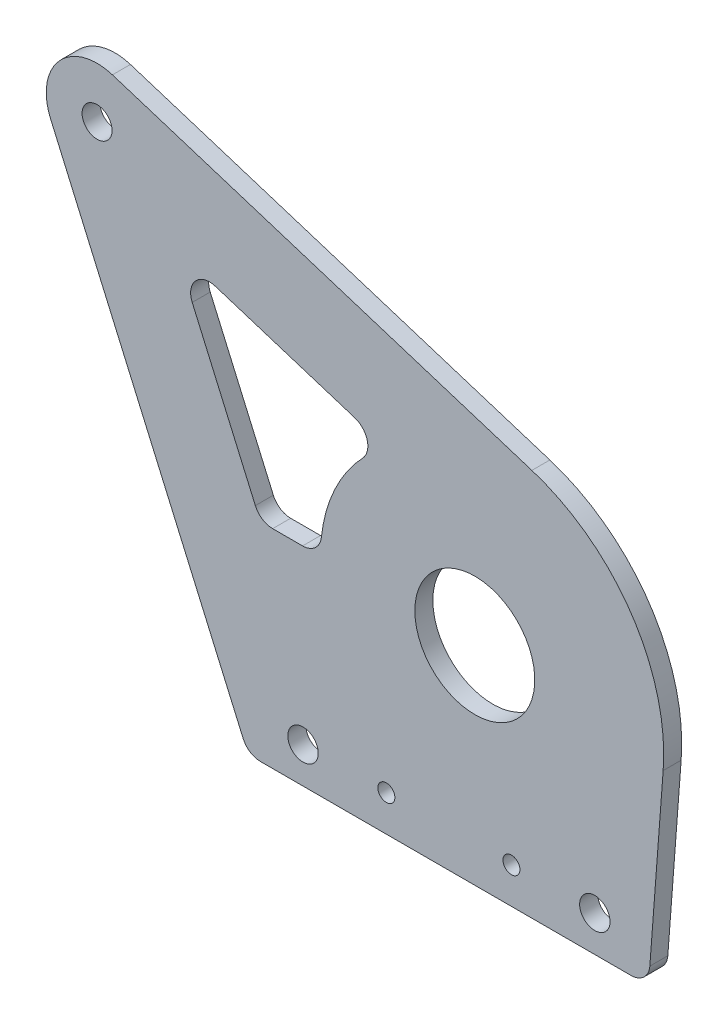
ISO-10303-21;
HEADER;
FILE_DESCRIPTION(('STEP AP214'),'2;1');
FILE_NAME('part.step','',(''),(''),'','','');
FILE_SCHEMA(('AUTOMOTIVE_DESIGN { 1 0 10303 214 1 1 1 1 }'));
ENDSEC;
DATA;
#1=APPLICATION_CONTEXT('core data for automotive mechanical design processes');
#2=APPLICATION_PROTOCOL_DEFINITION('international standard','automotive_design',2000,#1);
#3=PRODUCT_CONTEXT('',#1,'mechanical');
#4=PRODUCT('Part','Part','',(#3));
#5=PRODUCT_RELATED_PRODUCT_CATEGORY('part','',(#4));
#6=PRODUCT_DEFINITION_FORMATION('','',#4);
#7=PRODUCT_DEFINITION_CONTEXT('part definition',#1,'design');
#8=PRODUCT_DEFINITION('design','',#6,#7);
#9=PRODUCT_DEFINITION_SHAPE('','',#8);
#10=(LENGTH_UNIT() NAMED_UNIT(*) SI_UNIT(.MILLI.,.METRE.));
#11=(NAMED_UNIT(*) PLANE_ANGLE_UNIT() SI_UNIT($,.RADIAN.));
#12=(NAMED_UNIT(*) SI_UNIT($,.STERADIAN.) SOLID_ANGLE_UNIT());
#13=UNCERTAINTY_MEASURE_WITH_UNIT(LENGTH_MEASURE(1.E-05),#10,'distance_accuracy_value','');
#14=(GEOMETRIC_REPRESENTATION_CONTEXT(3) GLOBAL_UNCERTAINTY_ASSIGNED_CONTEXT((#13)) GLOBAL_UNIT_ASSIGNED_CONTEXT((#10,
#11,#12)) REPRESENTATION_CONTEXT('',''));
#15=CARTESIAN_POINT('',(0.,0.,0.));
#16=DIRECTION('',(0.,0.,1.));
#17=DIRECTION('',(1.,0.,0.));
#18=AXIS2_PLACEMENT_3D('',#15,#16,#17);
#19=CARTESIAN_POINT('',(-45.9765237436757,55.,34.7625));
#20=DIRECTION('',(0.,0.,-1.));
#21=DIRECTION('',(-1.,0.,0.));
#22=AXIS2_PLACEMENT_3D('',#19,#20,#21);
#23=PLANE('',#22);
#24=DIRECTION('',(1.,0.,0.));
#25=VECTOR('',#24,1.);
#26=CARTESIAN_POINT('',(-102.765720109967,55.,34.7625));
#27=LINE('',#26,#25);
#28=CARTESIAN_POINT('',(-99.4950500240803,55.,34.7625));
#29=VERTEX_POINT('',#28);
#30=CARTESIAN_POINT('',(-91.5782301262224,55.,34.7625));
#31=VERTEX_POINT('',#30);
#32=EDGE_CURVE('E273',#29,#31,#27,.T.);
#33=ORIENTED_EDGE('',*,*,#32,.F.);
#34=CARTESIAN_POINT('',(-99.4950500240803,60.,34.7625));
#35=DIRECTION('',(0.,0.,-1.));
#36=DIRECTION('',(-1.,0.,0.));
#37=AXIS2_PLACEMENT_3D('',#34,#35,#36);
#38=CIRCLE('',#37,5.);
#39=CARTESIAN_POINT('',(-104.076169129461,57.9966658435705,34.7625));
#40=VERTEX_POINT('',#39);
#41=EDGE_CURVE('E238',#29,#40,#38,.T.);
#42=ORIENTED_EDGE('',*,*,#41,.T.);
#43=DIRECTION('',(0.400666831285897,-0.916223821076116,0.));
#44=VECTOR('',#43,1.);
#45=CARTESIAN_POINT('',(-125.205078879288,106.313144559887,34.7625));
#46=LINE('',#45,#44);
#47=CARTESIAN_POINT('',(-120.7896266242,96.2161207459809,34.7625));
#48=VERTEX_POINT('',#47);
#49=EDGE_CURVE('E248',#48,#40,#46,.T.);
#50=ORIENTED_EDGE('',*,*,#49,.F.);
#51=CARTESIAN_POINT('',(-116.208507518819,98.2194549024104,34.7625));
#52=DIRECTION('',(0.,0.,-1.));
#53=DIRECTION('',(-1.,0.,0.));
#54=AXIS2_PLACEMENT_3D('',#51,#52,#53);
#55=CIRCLE('',#54,5.);
#56=CARTESIAN_POINT('',(-114.699020514716,102.986157010204,34.7625));
#57=VERTEX_POINT('',#56);
#58=EDGE_CURVE('E48',#48,#57,#55,.T.);
#59=ORIENTED_EDGE('',*,*,#58,.T.);
#60=DIRECTION('',(-0.95334042155868,0.30189740082074,0.));
#61=VECTOR('',#60,1.);
#62=CARTESIAN_POINT('',(-125.205078879288,106.313144559887,34.7625));
#63=LINE('',#62,#61);
#64=CARTESIAN_POINT('',(-77.7884915726018,91.297580192781,34.7625));
#65=VERTEX_POINT('',#64);
#66=EDGE_CURVE('E247',#65,#57,#63,.T.);
#67=ORIENTED_EDGE('',*,*,#66,.F.);
#68=CARTESIAN_POINT('',(-79.2979785767055,86.5308780849876,34.7625));
#69=DIRECTION('',(0.,0.,-1.));
#70=DIRECTION('',(-1.,0.,0.));
#71=AXIS2_PLACEMENT_3D('',#68,#69,#70);
#72=CIRCLE('',#71,5.);
#73=CARTESIAN_POINT('',(-75.6662123823698,83.0942701193214,34.7625));
#74=VERTEX_POINT('',#73);
#75=EDGE_CURVE('E230',#65,#74,#72,.T.);
#76=ORIENTED_EDGE('',*,*,#75,.T.);
#77=CARTESIAN_POINT('',(-45.9765237436757,55.,34.7625));
#78=DIRECTION('',(0.,0.,-1.));
#79=DIRECTION('',(1.,0.,0.));
#80=AXIS2_PLACEMENT_3D('',#77,#78,#79);
#81=CIRCLE('',#80,40.875);
#82=CARTESIAN_POINT('',(-86.608016896517,59.4550408719346,34.7625));
#83=VERTEX_POINT('',#82);
#84=EDGE_CURVE('E257',#83,#74,#81,.T.);
#85=ORIENTED_EDGE('',*,*,#84,.F.);
#86=CARTESIAN_POINT('',(-91.5782301262224,60.,34.7625));
#87=DIRECTION('',(0.,0.,-1.));
#88=DIRECTION('',(-1.,0.,0.));
#89=AXIS2_PLACEMENT_3D('',#86,#87,#88);
#90=CIRCLE('',#89,5.);
#91=EDGE_CURVE('E234',#83,#31,#90,.T.);
#92=ORIENTED_EDGE('',*,*,#91,.T.);
#93=EDGE_LOOP('',(#33,#42,#50,#59,#67,#76,#85,#92));
#94=FACE_BOUND('',#93,.T.);
#95=CARTESIAN_POINT('',(-69.3886421718834,9.525,34.7625));
#96=DIRECTION('',(0.,0.,1.));
#97=DIRECTION('',(1.,0.,0.));
#98=AXIS2_PLACEMENT_3D('',#95,#96,#97);
#99=CIRCLE('',#98,2.24999999999999);
#100=CARTESIAN_POINT('',(-67.1386421718834,9.525,34.7625));
#101=VERTEX_POINT('',#100);
#102=EDGE_CURVE('E271',#101,#101,#99,.T.);
#103=ORIENTED_EDGE('',*,*,#102,.F.);
#104=EDGE_LOOP('',(#103));
#105=FACE_BOUND('',#104,.T.);
#106=CARTESIAN_POINT('',(-91.4598564098834,9.52499999999999,34.7625));
#107=DIRECTION('',(0.,0.,1.));
#108=DIRECTION('',(1.,0.,0.));
#109=AXIS2_PLACEMENT_3D('',#106,#107,#108);
#110=CIRCLE('',#109,4.025);
#111=CARTESIAN_POINT('',(-87.4348564098834,9.52499999999999,34.7625));
#112=VERTEX_POINT('',#111);
#113=EDGE_CURVE('E192',#112,#112,#110,.T.);
#114=ORIENTED_EDGE('',*,*,#113,.F.);
#115=EDGE_LOOP('',(#114));
#116=FACE_BOUND('',#115,.T.);
#117=CARTESIAN_POINT('',(-14.2106070377648,9.52500000000001,34.7625));
#118=DIRECTION('',(0.,0.,1.));
#119=DIRECTION('',(1.,0.,0.));
#120=AXIS2_PLACEMENT_3D('',#117,#118,#119);
#121=CIRCLE('',#120,4.025);
#122=CARTESIAN_POINT('',(-10.1856070377648,9.52500000000001,34.7625));
#123=VERTEX_POINT('',#122);
#124=EDGE_CURVE('E295',#123,#123,#121,.T.);
#125=ORIENTED_EDGE('',*,*,#124,.F.);
#126=EDGE_LOOP('',(#125));
#127=FACE_BOUND('',#126,.T.);
#128=CARTESIAN_POINT('',(-45.9765237436757,55.,34.7625));
#129=DIRECTION('',(0.,0.,-1.));
#130=DIRECTION('',(-1.,0.,0.));
#131=AXIS2_PLACEMENT_3D('',#128,#129,#130);
#132=CIRCLE('',#131,15.875);
#133=CARTESIAN_POINT('',(-61.8515237436757,55.,34.7625));
#134=VERTEX_POINT('',#133);
#135=EDGE_CURVE('E195',#134,#134,#132,.T.);
#136=ORIENTED_EDGE('',*,*,#135,.T.);
#137=EDGE_LOOP('',(#136));
#138=FACE_BOUND('',#137,.T.);
#139=CARTESIAN_POINT('',(-145.976523743676,125.,34.7625));
#140=DIRECTION('',(0.,0.,-1.));
#141=DIRECTION('',(-1.,0.,0.));
#142=AXIS2_PLACEMENT_3D('',#139,#140,#141);
#143=CIRCLE('',#142,3.96874999999999);
#144=CARTESIAN_POINT('',(-149.945273743676,125.,34.7625));
#145=VERTEX_POINT('',#144);
#146=EDGE_CURVE('E191',#145,#145,#143,.T.);
#147=ORIENTED_EDGE('',*,*,#146,.T.);
#148=EDGE_LOOP('',(#147));
#149=FACE_BOUND('',#148,.T.);
#150=DIRECTION('',(1.,0.,0.));
#151=VECTOR('',#150,1.);
#152=CARTESIAN_POINT('',(0.,0.,34.7625));
#153=LINE('',#152,#151);
#154=CARTESIAN_POINT('',(-102.729329914113,0.,34.7625));
#155=VERTEX_POINT('',#154);
#156=CARTESIAN_POINT('',(-4.63553198775184,0.,34.7625));
#157=VERTEX_POINT('',#156);
#158=EDGE_CURVE('E308',#155,#157,#153,.T.);
#159=ORIENTED_EDGE('',*,*,#158,.T.);
#160=CARTESIAN_POINT('',(-4.63553198775184,5.,34.7625));
#161=DIRECTION('',(0.,0.,-1.));
#162=DIRECTION('',(-1.,0.,0.));
#163=AXIS2_PLACEMENT_3D('',#160,#161,#162);
#164=CIRCLE('',#163,5.);
#165=CARTESIAN_POINT('',(0.350180832343764,4.62228625185952,34.7625));
#166=VERTEX_POINT('',#165);
#167=EDGE_CURVE('E207',#157,#166,#164,.F.);
#168=ORIENTED_EDGE('',*,*,#167,.T.);
#169=DIRECTION('',(0.0755427496280952,0.997142564019121,0.));
#170=VECTOR('',#169,1.);
#171=CARTESIAN_POINT('',(0.,0.,34.7625));
#172=LINE('',#171,#170);
#173=CARTESIAN_POINT('',(3.88060445728038,51.2228625185952,34.7625));
#174=VERTEX_POINT('',#173);
#175=EDGE_CURVE('E170',#166,#174,#172,.T.);
#176=ORIENTED_EDGE('',*,*,#175,.T.);
#177=CARTESIAN_POINT('',(-45.9765237436757,55.,34.7625));
#178=DIRECTION('',(0.,0.,1.));
#179=DIRECTION('',(-1.,0.,0.));
#180=AXIS2_PLACEMENT_3D('',#177,#178,#179);
#181=CIRCLE('',#180,50.);
#182=CARTESIAN_POINT('',(-30.8816537026386,102.667021077934,34.7625));
#183=VERTEX_POINT('',#182);
#184=EDGE_CURVE('E164',#174,#183,#181,.T.);
#185=ORIENTED_EDGE('',*,*,#184,.T.);
#186=DIRECTION('',(-0.95334042155868,0.301897400820741,0.));
#187=VECTOR('',#186,1.);
#188=CARTESIAN_POINT('',(-141.914219316021,137.828063458088,34.7625));
#189=LINE('',#188,#187);
#190=CARTESIAN_POINT('',(-141.914219316021,137.828063458088,34.7625));
#191=VERTEX_POINT('',#190);
#192=EDGE_CURVE('E153',#183,#191,#189,.T.);
#193=ORIENTED_EDGE('',*,*,#192,.T.);
#194=CARTESIAN_POINT('',(-145.976523743676,125.,34.7625));
#195=DIRECTION('',(0.,0.,1.));
#196=DIRECTION('',(1.,0.,0.));
#197=AXIS2_PLACEMENT_3D('',#194,#195,#196);
#198=CIRCLE('',#197,13.4559105729665);
#199=CARTESIAN_POINT('',(-158.305149544898,119.608662948663,34.7625));
#200=VERTEX_POINT('',#199);
#201=EDGE_CURVE('E163',#191,#200,#198,.T.);
#202=ORIENTED_EDGE('',*,*,#201,.T.);
#203=DIRECTION('',(0.400666831285897,-0.916223821076116,0.));
#204=VECTOR('',#203,1.);
#205=CARTESIAN_POINT('',(-106.,0.,34.7625));
#206=LINE('',#205,#204);
#207=CARTESIAN_POINT('',(-107.310449019494,2.9966658435705,34.7625));
#208=VERTEX_POINT('',#207);
#209=EDGE_CURVE('E305',#200,#208,#206,.T.);
#210=ORIENTED_EDGE('',*,*,#209,.T.);
#211=CARTESIAN_POINT('',(-102.729329914113,4.99999999999998,34.7625));
#212=DIRECTION('',(0.,0.,-1.));
#213=DIRECTION('',(-1.,0.,0.));
#214=AXIS2_PLACEMENT_3D('',#211,#212,#213);
#215=CIRCLE('',#214,5.);
#216=EDGE_CURVE('E205',#208,#155,#215,.F.);
#217=ORIENTED_EDGE('',*,*,#216,.T.);
#218=EDGE_LOOP('',(#159,#168,#176,#185,#193,#202,#210,#217));
#219=FACE_BOUND('',#218,.T.);
#220=CARTESIAN_POINT('',(-36.2818211132944,9.525,34.7625));
#221=DIRECTION('',(0.,0.,1.));
#222=DIRECTION('',(1.,0.,0.));
#223=AXIS2_PLACEMENT_3D('',#220,#221,#222);
#224=CIRCLE('',#223,2.25);
#225=CARTESIAN_POINT('',(-34.0318211132945,9.525,34.7625));
#226=VERTEX_POINT('',#225);
#227=EDGE_CURVE('E283',#226,#226,#224,.T.);
#228=ORIENTED_EDGE('',*,*,#227,.F.);
#229=EDGE_LOOP('',(#228));
#230=FACE_BOUND('',#229,.T.);
#231=ADVANCED_FACE('F40',(#94,#105,#116,#127,#138,#149,#219,#230),#23,.F.);
#232=CARTESIAN_POINT('',(-45.9765237436757,55.,34.7625));
#233=DIRECTION('',(0.,0.,-1.));
#234=DIRECTION('',(-1.,0.,0.));
#235=AXIS2_PLACEMENT_3D('',#232,#233,#234);
#236=CYLINDRICAL_SURFACE('',#235,50.);
#237=CARTESIAN_POINT('',(-45.9765237436757,55.,30.));
#238=DIRECTION('',(0.,0.,1.));
#239=DIRECTION('',(-1.,0.,0.));
#240=AXIS2_PLACEMENT_3D('',#237,#238,#239);
#241=CIRCLE('',#240,50.);
#242=CARTESIAN_POINT('',(3.88060445728038,51.2228625185952,30.));
#243=VERTEX_POINT('',#242);
#244=CARTESIAN_POINT('',(-30.8816537026386,102.667021077934,30.));
#245=VERTEX_POINT('',#244);
#246=EDGE_CURVE('E178',#243,#245,#241,.T.);
#247=ORIENTED_EDGE('',*,*,#246,.T.);
#248=DIRECTION('',(0.,0.,-1.));
#249=VECTOR('',#248,1.);
#250=CARTESIAN_POINT('',(-30.8816537026386,102.667021077934,34.7625));
#251=LINE('',#250,#249);
#252=EDGE_CURVE('E157',#183,#245,#251,.T.);
#253=ORIENTED_EDGE('',*,*,#252,.F.);
#254=ORIENTED_EDGE('',*,*,#184,.F.);
#255=DIRECTION('',(0.,0.,-1.));
#256=VECTOR('',#255,1.);
#257=CARTESIAN_POINT('',(3.88060445728038,51.2228625185952,34.7625));
#258=LINE('',#257,#256);
#259=EDGE_CURVE('E311',#174,#243,#258,.T.);
#260=ORIENTED_EDGE('',*,*,#259,.T.);
#261=EDGE_LOOP('',(#247,#253,#254,#260));
#262=FACE_BOUND('',#261,.T.);
#263=ADVANCED_FACE('F176',(#262),#236,.T.);
#264=CARTESIAN_POINT('',(-141.914219316021,137.828063458088,34.7625));
#265=DIRECTION('',(-0.301897400820741,-0.95334042155868,0.));
#266=DIRECTION('',(0.95334042155868,-0.301897400820741,0.));
#267=AXIS2_PLACEMENT_3D('',#264,#265,#266);
#268=PLANE('',#267);
#269=DIRECTION('',(-0.95334042155868,0.301897400820741,0.));
#270=VECTOR('',#269,1.);
#271=CARTESIAN_POINT('',(-141.914219316021,137.828063458088,30.));
#272=LINE('',#271,#270);
#273=CARTESIAN_POINT('',(-141.914219316021,137.828063458088,30.));
#274=VERTEX_POINT('',#273);
#275=EDGE_CURVE('E313',#245,#274,#272,.T.);
#276=ORIENTED_EDGE('',*,*,#275,.T.);
#277=DIRECTION('',(0.,0.,-1.));
#278=VECTOR('',#277,1.);
#279=CARTESIAN_POINT('',(-141.914219316021,137.828063458088,34.7625));
#280=LINE('',#279,#278);
#281=EDGE_CURVE('E160',#191,#274,#280,.T.);
#282=ORIENTED_EDGE('',*,*,#281,.F.);
#283=ORIENTED_EDGE('',*,*,#192,.F.);
#284=ORIENTED_EDGE('',*,*,#252,.T.);
#285=EDGE_LOOP('',(#276,#282,#283,#284));
#286=FACE_BOUND('',#285,.T.);
#287=ADVANCED_FACE('F155',(#286),#268,.F.);
#288=CARTESIAN_POINT('',(-145.976523743676,125.,34.7625));
#289=DIRECTION('',(0.,0.,-1.));
#290=DIRECTION('',(-1.,0.,0.));
#291=AXIS2_PLACEMENT_3D('',#288,#289,#290);
#292=CYLINDRICAL_SURFACE('',#291,13.4559105729665);
#293=CARTESIAN_POINT('',(-145.976523743676,125.,30.));
#294=DIRECTION('',(0.,0.,1.));
#295=DIRECTION('',(1.,0.,0.));
#296=AXIS2_PLACEMENT_3D('',#293,#294,#295);
#297=CIRCLE('',#296,13.4559105729665);
#298=CARTESIAN_POINT('',(-158.305149544898,119.608662948663,30.));
#299=VERTEX_POINT('',#298);
#300=EDGE_CURVE('E315',#274,#299,#297,.T.);
#301=ORIENTED_EDGE('',*,*,#300,.T.);
#302=DIRECTION('',(0.,0.,-1.));
#303=VECTOR('',#302,1.);
#304=CARTESIAN_POINT('',(-158.305149544898,119.608662948663,34.7625));
#305=LINE('',#304,#303);
#306=EDGE_CURVE('E184',#200,#299,#305,.T.);
#307=ORIENTED_EDGE('',*,*,#306,.F.);
#308=ORIENTED_EDGE('',*,*,#201,.F.);
#309=ORIENTED_EDGE('',*,*,#281,.T.);
#310=EDGE_LOOP('',(#301,#307,#308,#309));
#311=FACE_BOUND('',#310,.T.);
#312=ADVANCED_FACE('F351',(#311),#292,.T.);
#313=CARTESIAN_POINT('',(-106.,0.,34.7625));
#314=DIRECTION('',(0.916223821076116,0.400666831285897,0.));
#315=DIRECTION('',(-0.400666831285897,0.916223821076116,0.));
#316=AXIS2_PLACEMENT_3D('',#313,#314,#315);
#317=PLANE('',#316);
#318=DIRECTION('',(0.400666831285897,-0.916223821076116,0.));
#319=VECTOR('',#318,1.);
#320=CARTESIAN_POINT('',(-106.,0.,30.));
#321=LINE('',#320,#319);
#322=CARTESIAN_POINT('',(-107.310449019494,2.9966658435705,30.));
#323=VERTEX_POINT('',#322);
#324=EDGE_CURVE('E317',#299,#323,#321,.T.);
#325=ORIENTED_EDGE('',*,*,#324,.T.);
#326=DIRECTION('',(0.,0.,-1.));
#327=VECTOR('',#326,1.);
#328=CARTESIAN_POINT('',(-107.310449019494,2.9966658435705,34.7625));
#329=LINE('',#328,#327);
#330=EDGE_CURVE('E209',#323,#208,#329,.F.);
#331=ORIENTED_EDGE('',*,*,#330,.T.);
#332=ORIENTED_EDGE('',*,*,#209,.F.);
#333=ORIENTED_EDGE('',*,*,#306,.T.);
#334=EDGE_LOOP('',(#325,#331,#332,#333));
#335=FACE_BOUND('',#334,.T.);
#336=ADVANCED_FACE('F329',(#335),#317,.F.);
#337=CARTESIAN_POINT('',(0.,0.,34.7625));
#338=DIRECTION('',(0.,1.,0.));
#339=DIRECTION('',(-1.,0.,0.));
#340=AXIS2_PLACEMENT_3D('',#337,#338,#339);
#341=PLANE('',#340);
#342=DIRECTION('',(1.,0.,0.));
#343=VECTOR('',#342,1.);
#344=CARTESIAN_POINT('',(0.,0.,30.));
#345=LINE('',#344,#343);
#346=CARTESIAN_POINT('',(-102.729329914113,0.,30.));
#347=VERTEX_POINT('',#346);
#348=CARTESIAN_POINT('',(-4.63553198775184,0.,30.));
#349=VERTEX_POINT('',#348);
#350=EDGE_CURVE('E320',#347,#349,#345,.T.);
#351=ORIENTED_EDGE('',*,*,#350,.T.);
#352=DIRECTION('',(0.,0.,-1.));
#353=VECTOR('',#352,1.);
#354=CARTESIAN_POINT('',(-4.63553198775184,0.,34.7625));
#355=LINE('',#354,#353);
#356=EDGE_CURVE('E203',#349,#157,#355,.F.);
#357=ORIENTED_EDGE('',*,*,#356,.T.);
#358=ORIENTED_EDGE('',*,*,#158,.F.);
#359=DIRECTION('',(0.,0.,-1.));
#360=VECTOR('',#359,1.);
#361=CARTESIAN_POINT('',(-102.729329914113,0.,34.7625));
#362=LINE('',#361,#360);
#363=EDGE_CURVE('E200',#155,#347,#362,.T.);
#364=ORIENTED_EDGE('',*,*,#363,.T.);
#365=EDGE_LOOP('',(#351,#357,#358,#364));
#366=FACE_BOUND('',#365,.T.);
#367=ADVANCED_FACE('F343',(#366),#341,.F.);
#368=CARTESIAN_POINT('',(0.,0.,34.7625));
#369=DIRECTION('',(-0.997142564019121,0.0755427496280952,0.));
#370=DIRECTION('',(-0.0755427496280952,-0.997142564019121,0.));
#371=AXIS2_PLACEMENT_3D('',#368,#369,#370);
#372=PLANE('',#371);
#373=ORIENTED_EDGE('',*,*,#175,.F.);
#374=DIRECTION('',(0.,0.,-1.));
#375=VECTOR('',#374,1.);
#376=CARTESIAN_POINT('',(0.350180832343764,4.62228625185952,34.7625));
#377=LINE('',#376,#375);
#378=CARTESIAN_POINT('',(0.350180832343764,4.62228625185952,30.));
#379=VERTEX_POINT('',#378);
#380=EDGE_CURVE('E179',#166,#379,#377,.T.);
#381=ORIENTED_EDGE('',*,*,#380,.T.);
#382=DIRECTION('',(0.0755427496280952,0.997142564019121,0.));
#383=VECTOR('',#382,1.);
#384=CARTESIAN_POINT('',(0.,0.,30.));
#385=LINE('',#384,#383);
#386=EDGE_CURVE('E174',#379,#243,#385,.T.);
#387=ORIENTED_EDGE('',*,*,#386,.T.);
#388=ORIENTED_EDGE('',*,*,#259,.F.);
#389=EDGE_LOOP('',(#373,#381,#387,#388));
#390=FACE_BOUND('',#389,.T.);
#391=ADVANCED_FACE('F350',(#390),#372,.F.);
#392=CARTESIAN_POINT('',(-45.9765237436757,55.,30.));
#393=DIRECTION('',(0.,0.,-1.));
#394=DIRECTION('',(-1.,0.,0.));
#395=AXIS2_PLACEMENT_3D('',#392,#393,#394);
#396=PLANE('',#395);
#397=DIRECTION('',(-0.95334042155868,0.30189740082074,0.));
#398=VECTOR('',#397,1.);
#399=CARTESIAN_POINT('',(-125.205078879288,106.313144559887,30.));
#400=LINE('',#399,#398);
#401=CARTESIAN_POINT('',(-77.7884915726018,91.297580192781,30.));
#402=VERTEX_POINT('',#401);
#403=CARTESIAN_POINT('',(-114.699020514716,102.986157010204,30.));
#404=VERTEX_POINT('',#403);
#405=EDGE_CURVE('E269',#402,#404,#400,.T.);
#406=ORIENTED_EDGE('',*,*,#405,.T.);
#407=CARTESIAN_POINT('',(-116.208507518819,98.2194549024104,30.));
#408=DIRECTION('',(0.,0.,-1.));
#409=DIRECTION('',(-1.,0.,0.));
#410=AXIS2_PLACEMENT_3D('',#407,#408,#409);
#411=CIRCLE('',#410,5.);
#412=CARTESIAN_POINT('',(-120.7896266242,96.2161207459809,30.));
#413=VERTEX_POINT('',#412);
#414=EDGE_CURVE('E11',#404,#413,#411,.F.);
#415=ORIENTED_EDGE('',*,*,#414,.T.);
#416=DIRECTION('',(0.400666831285897,-0.916223821076116,0.));
#417=VECTOR('',#416,1.);
#418=CARTESIAN_POINT('',(-125.205078879288,106.313144559887,30.));
#419=LINE('',#418,#417);
#420=CARTESIAN_POINT('',(-104.076169129461,57.9966658435705,30.));
#421=VERTEX_POINT('',#420);
#422=EDGE_CURVE('E256',#413,#421,#419,.T.);
#423=ORIENTED_EDGE('',*,*,#422,.T.);
#424=CARTESIAN_POINT('',(-99.4950500240803,60.,30.));
#425=DIRECTION('',(0.,0.,-1.));
#426=DIRECTION('',(-1.,0.,0.));
#427=AXIS2_PLACEMENT_3D('',#424,#425,#426);
#428=CIRCLE('',#427,5.);
#429=CARTESIAN_POINT('',(-99.4950500240803,55.,30.));
#430=VERTEX_POINT('',#429);
#431=EDGE_CURVE('E240',#421,#430,#428,.F.);
#432=ORIENTED_EDGE('',*,*,#431,.T.);
#433=DIRECTION('',(1.,0.,0.));
#434=VECTOR('',#433,1.);
#435=CARTESIAN_POINT('',(-102.765720109967,55.,30.));
#436=LINE('',#435,#434);
#437=CARTESIAN_POINT('',(-91.5782301262224,55.,30.));
#438=VERTEX_POINT('',#437);
#439=EDGE_CURVE('E261',#430,#438,#436,.T.);
#440=ORIENTED_EDGE('',*,*,#439,.T.);
#441=CARTESIAN_POINT('',(-91.5782301262224,60.,30.));
#442=DIRECTION('',(0.,0.,-1.));
#443=DIRECTION('',(-1.,0.,0.));
#444=AXIS2_PLACEMENT_3D('',#441,#442,#443);
#445=CIRCLE('',#444,5.);
#446=CARTESIAN_POINT('',(-86.608016896517,59.4550408719346,30.));
#447=VERTEX_POINT('',#446);
#448=EDGE_CURVE('E236',#438,#447,#445,.F.);
#449=ORIENTED_EDGE('',*,*,#448,.T.);
#450=CARTESIAN_POINT('',(-45.9765237436757,55.,30.));
#451=DIRECTION('',(0.,0.,-1.));
#452=DIRECTION('',(1.,0.,0.));
#453=AXIS2_PLACEMENT_3D('',#450,#451,#452);
#454=CIRCLE('',#453,40.875);
#455=CARTESIAN_POINT('',(-75.6662123823698,83.0942701193214,30.));
#456=VERTEX_POINT('',#455);
#457=EDGE_CURVE('E264',#447,#456,#454,.T.);
#458=ORIENTED_EDGE('',*,*,#457,.T.);
#459=CARTESIAN_POINT('',(-79.2979785767055,86.5308780849876,30.));
#460=DIRECTION('',(0.,0.,-1.));
#461=DIRECTION('',(-1.,0.,0.));
#462=AXIS2_PLACEMENT_3D('',#459,#460,#461);
#463=CIRCLE('',#462,5.);
#464=EDGE_CURVE('E232',#456,#402,#463,.F.);
#465=ORIENTED_EDGE('',*,*,#464,.T.);
#466=EDGE_LOOP('',(#406,#415,#423,#432,#440,#449,#458,#465));
#467=FACE_BOUND('',#466,.T.);
#468=CARTESIAN_POINT('',(-69.3886421718834,9.525,30.));
#469=DIRECTION('',(0.,0.,-1.));
#470=DIRECTION('',(-1.,0.,0.));
#471=AXIS2_PLACEMENT_3D('',#468,#469,#470);
#472=CIRCLE('',#471,2.24999999999999);
#473=CARTESIAN_POINT('',(-71.6386421718834,9.525,30.));
#474=VERTEX_POINT('',#473);
#475=EDGE_CURVE('E280',#474,#474,#472,.T.);
#476=ORIENTED_EDGE('',*,*,#475,.F.);
#477=EDGE_LOOP('',(#476));
#478=FACE_BOUND('',#477,.T.);
#479=CARTESIAN_POINT('',(-36.2818211132944,9.525,30.));
#480=DIRECTION('',(0.,0.,-1.));
#481=DIRECTION('',(-1.,0.,0.));
#482=AXIS2_PLACEMENT_3D('',#479,#480,#481);
#483=CIRCLE('',#482,2.25);
#484=CARTESIAN_POINT('',(-38.5318211132944,9.525,30.));
#485=VERTEX_POINT('',#484);
#486=EDGE_CURVE('E286',#485,#485,#483,.T.);
#487=ORIENTED_EDGE('',*,*,#486,.F.);
#488=EDGE_LOOP('',(#487));
#489=FACE_BOUND('',#488,.T.);
#490=CARTESIAN_POINT('',(-91.4598564098834,9.52499999999999,30.));
#491=DIRECTION('',(0.,0.,-1.));
#492=DIRECTION('',(-1.,0.,0.));
#493=AXIS2_PLACEMENT_3D('',#490,#491,#492);
#494=CIRCLE('',#493,4.025);
#495=CARTESIAN_POINT('',(-87.4348564098834,9.52499999999999,30.));
#496=VERTEX_POINT('',#495);
#497=EDGE_CURVE('E292',#496,#496,#494,.F.);
#498=ORIENTED_EDGE('',*,*,#497,.T.);
#499=EDGE_LOOP('',(#498));
#500=FACE_BOUND('',#499,.T.);
#501=CARTESIAN_POINT('',(-14.2106070377648,9.52500000000001,30.));
#502=DIRECTION('',(0.,0.,-1.));
#503=DIRECTION('',(-1.,0.,0.));
#504=AXIS2_PLACEMENT_3D('',#501,#502,#503);
#505=CIRCLE('',#504,4.025);
#506=CARTESIAN_POINT('',(-10.1856070377648,9.52500000000001,30.));
#507=VERTEX_POINT('',#506);
#508=EDGE_CURVE('E289',#507,#507,#505,.F.);
#509=ORIENTED_EDGE('',*,*,#508,.T.);
#510=EDGE_LOOP('',(#509));
#511=FACE_BOUND('',#510,.T.);
#512=CARTESIAN_POINT('',(-45.9765237436757,55.,30.));
#513=DIRECTION('',(0.,0.,-1.));
#514=DIRECTION('',(-1.,0.,0.));
#515=AXIS2_PLACEMENT_3D('',#512,#513,#514);
#516=CIRCLE('',#515,15.875);
#517=CARTESIAN_POINT('',(-61.8515237436757,55.,30.));
#518=VERTEX_POINT('',#517);
#519=EDGE_CURVE('E193',#518,#518,#516,.T.);
#520=ORIENTED_EDGE('',*,*,#519,.F.);
#521=EDGE_LOOP('',(#520));
#522=FACE_BOUND('',#521,.T.);
#523=CARTESIAN_POINT('',(-145.976523743676,125.,30.));
#524=DIRECTION('',(0.,0.,-1.));
#525=DIRECTION('',(-1.,0.,0.));
#526=AXIS2_PLACEMENT_3D('',#523,#524,#525);
#527=CIRCLE('',#526,3.96874999999999);
#528=CARTESIAN_POINT('',(-149.945273743676,125.,30.));
#529=VERTEX_POINT('',#528);
#530=EDGE_CURVE('E188',#529,#529,#527,.T.);
#531=ORIENTED_EDGE('',*,*,#530,.F.);
#532=EDGE_LOOP('',(#531));
#533=FACE_BOUND('',#532,.T.);
#534=ORIENTED_EDGE('',*,*,#386,.F.);
#535=CARTESIAN_POINT('',(-4.63553198775184,5.,30.));
#536=DIRECTION('',(0.,0.,-1.));
#537=DIRECTION('',(-1.,0.,0.));
#538=AXIS2_PLACEMENT_3D('',#535,#536,#537);
#539=CIRCLE('',#538,5.);
#540=EDGE_CURVE('E198',#379,#349,#539,.T.);
#541=ORIENTED_EDGE('',*,*,#540,.T.);
#542=ORIENTED_EDGE('',*,*,#350,.F.);
#543=CARTESIAN_POINT('',(-102.729329914113,4.99999999999998,30.));
#544=DIRECTION('',(0.,0.,-1.));
#545=DIRECTION('',(-1.,0.,0.));
#546=AXIS2_PLACEMENT_3D('',#543,#544,#545);
#547=CIRCLE('',#546,5.);
#548=EDGE_CURVE('E182',#347,#323,#547,.T.);
#549=ORIENTED_EDGE('',*,*,#548,.T.);
#550=ORIENTED_EDGE('',*,*,#324,.F.);
#551=ORIENTED_EDGE('',*,*,#300,.F.);
#552=ORIENTED_EDGE('',*,*,#275,.F.);
#553=ORIENTED_EDGE('',*,*,#246,.F.);
#554=EDGE_LOOP('',(#534,#541,#542,#549,#550,#551,#552,#553));
#555=FACE_BOUND('',#554,.T.);
#556=ADVANCED_FACE('F335',(#467,#478,#489,#500,#511,#522,#533,#555),#396,.T.);
#557=CARTESIAN_POINT('',(-145.976523743676,125.,0.));
#558=DIRECTION('',(0.,0.,1.));
#559=DIRECTION('',(1.,0.,0.));
#560=AXIS2_PLACEMENT_3D('',#557,#558,#559);
#561=CYLINDRICAL_SURFACE('',#560,3.96874999999999);
#562=ORIENTED_EDGE('',*,*,#530,.T.);
#563=EDGE_LOOP('',(#562));
#564=FACE_BOUND('',#563,.T.);
#565=ORIENTED_EDGE('',*,*,#146,.F.);
#566=EDGE_LOOP('',(#565));
#567=FACE_BOUND('',#566,.T.);
#568=ADVANCED_FACE('F368',(#564,#567),#561,.F.);
#569=CARTESIAN_POINT('',(-45.9765237436757,55.,0.));
#570=DIRECTION('',(0.,0.,1.));
#571=DIRECTION('',(1.,0.,0.));
#572=AXIS2_PLACEMENT_3D('',#569,#570,#571);
#573=CYLINDRICAL_SURFACE('',#572,15.875);
#574=ORIENTED_EDGE('',*,*,#519,.T.);
#575=EDGE_LOOP('',(#574));
#576=FACE_BOUND('',#575,.T.);
#577=ORIENTED_EDGE('',*,*,#135,.F.);
#578=EDGE_LOOP('',(#577));
#579=FACE_BOUND('',#578,.T.);
#580=ADVANCED_FACE('F395',(#576,#579),#573,.F.);
#581=CARTESIAN_POINT('',(-4.63553198775184,5.,34.7625));
#582=DIRECTION('',(0.,0.,-1.));
#583=DIRECTION('',(-1.,0.,0.));
#584=AXIS2_PLACEMENT_3D('',#581,#582,#583);
#585=CYLINDRICAL_SURFACE('',#584,5.);
#586=ORIENTED_EDGE('',*,*,#167,.F.);
#587=ORIENTED_EDGE('',*,*,#356,.F.);
#588=ORIENTED_EDGE('',*,*,#540,.F.);
#589=ORIENTED_EDGE('',*,*,#380,.F.);
#590=EDGE_LOOP('',(#586,#587,#588,#589));
#591=FACE_BOUND('',#590,.T.);
#592=ADVANCED_FACE('F348',(#591),#585,.T.);
#593=CARTESIAN_POINT('',(-102.729329914113,4.99999999999998,34.7625));
#594=DIRECTION('',(0.,0.,-1.));
#595=DIRECTION('',(-1.,0.,0.));
#596=AXIS2_PLACEMENT_3D('',#593,#594,#595);
#597=CYLINDRICAL_SURFACE('',#596,5.);
#598=ORIENTED_EDGE('',*,*,#216,.F.);
#599=ORIENTED_EDGE('',*,*,#330,.F.);
#600=ORIENTED_EDGE('',*,*,#548,.F.);
#601=ORIENTED_EDGE('',*,*,#363,.F.);
#602=EDGE_LOOP('',(#598,#599,#600,#601));
#603=FACE_BOUND('',#602,.T.);
#604=ADVANCED_FACE('F340',(#603),#597,.T.);
#605=CARTESIAN_POINT('',(-14.2106070377648,9.52500000000001,-71.5988854041699));
#606=DIRECTION('',(0.,0.,1.));
#607=DIRECTION('',(1.,0.,0.));
#608=AXIS2_PLACEMENT_3D('',#605,#606,#607);
#609=CYLINDRICAL_SURFACE('',#608,4.025);
#610=CARTESIAN_POINT('',(-10.1856070377648,9.52500000000001,30.));
#611=CARTESIAN_POINT('',(-10.1856070377648,9.52500000000001,30.049609375));
#612=CARTESIAN_POINT('',(-10.1856070377648,9.52500000000001,30.09921875));
#613=CARTESIAN_POINT('',(-10.1856070377648,9.52500000000001,30.1984375));
#614=CARTESIAN_POINT('',(-10.1856070377648,9.52500000000001,30.248046875));
#615=CARTESIAN_POINT('',(-10.1856070377648,9.52500000000001,30.347265625));
#616=CARTESIAN_POINT('',(-10.1856070377648,9.52500000000001,30.396875));
#617=CARTESIAN_POINT('',(-10.1856070377648,9.52500000000001,30.49609375));
#618=CARTESIAN_POINT('',(-10.1856070377648,9.52500000000001,30.545703125));
#619=CARTESIAN_POINT('',(-10.1856070377648,9.52500000000001,30.644921875));
#620=CARTESIAN_POINT('',(-10.1856070377648,9.52500000000001,30.69453125));
#621=CARTESIAN_POINT('',(-10.1856070377648,9.52500000000001,30.79375));
#622=CARTESIAN_POINT('',(-10.1856070377648,9.52500000000001,30.843359375));
#623=CARTESIAN_POINT('',(-10.1856070377648,9.52500000000001,30.942578125));
#624=CARTESIAN_POINT('',(-10.1856070377648,9.52500000000001,30.9921875));
#625=CARTESIAN_POINT('',(-10.1856070377648,9.52500000000001,31.09140625));
#626=CARTESIAN_POINT('',(-10.1856070377648,9.52500000000001,31.141015625));
#627=CARTESIAN_POINT('',(-10.1856070377648,9.52500000000001,31.240234375));
#628=CARTESIAN_POINT('',(-10.1856070377648,9.52500000000001,31.28984375));
#629=CARTESIAN_POINT('',(-10.1856070377648,9.52500000000001,31.3890625));
#630=CARTESIAN_POINT('',(-10.1856070377648,9.52500000000001,31.438671875));
#631=CARTESIAN_POINT('',(-10.1856070377648,9.52500000000001,31.537890625));
#632=CARTESIAN_POINT('',(-10.1856070377648,9.52500000000001,31.5875));
#633=CARTESIAN_POINT('',(-10.1856070377648,9.52500000000001,31.68671875));
#634=CARTESIAN_POINT('',(-10.1856070377648,9.52500000000001,31.736328125));
#635=CARTESIAN_POINT('',(-10.1856070377648,9.52500000000001,31.835546875));
#636=CARTESIAN_POINT('',(-10.1856070377648,9.52500000000001,31.88515625));
#637=CARTESIAN_POINT('',(-10.1856070377648,9.52500000000001,31.984375));
#638=CARTESIAN_POINT('',(-10.1856070377648,9.52500000000001,32.033984375));
#639=CARTESIAN_POINT('',(-10.1856070377648,9.52500000000001,32.133203125));
#640=CARTESIAN_POINT('',(-10.1856070377648,9.52500000000001,32.1828125));
#641=CARTESIAN_POINT('',(-10.1856070377648,9.52500000000001,32.28203125));
#642=CARTESIAN_POINT('',(-10.1856070377648,9.52500000000001,32.331640625));
#643=CARTESIAN_POINT('',(-10.1856070377648,9.52500000000001,32.430859375));
#644=CARTESIAN_POINT('',(-10.1856070377648,9.52500000000001,32.48046875));
#645=CARTESIAN_POINT('',(-10.1856070377648,9.52500000000001,32.5796875));
#646=CARTESIAN_POINT('',(-10.1856070377648,9.52500000000001,32.629296875));
#647=CARTESIAN_POINT('',(-10.1856070377648,9.52500000000001,32.728515625));
#648=CARTESIAN_POINT('',(-10.1856070377648,9.52500000000001,32.778125));
#649=CARTESIAN_POINT('',(-10.1856070377648,9.52500000000001,32.87734375));
#650=CARTESIAN_POINT('',(-10.1856070377648,9.52500000000001,32.926953125));
#651=CARTESIAN_POINT('',(-10.1856070377648,9.52500000000001,33.026171875));
#652=CARTESIAN_POINT('',(-10.1856070377648,9.52500000000001,33.07578125));
#653=CARTESIAN_POINT('',(-10.1856070377648,9.52500000000001,33.175));
#654=CARTESIAN_POINT('',(-10.1856070377648,9.52500000000001,33.224609375));
#655=CARTESIAN_POINT('',(-10.1856070377648,9.52500000000001,33.323828125));
#656=CARTESIAN_POINT('',(-10.1856070377648,9.52500000000001,33.3734375));
#657=CARTESIAN_POINT('',(-10.1856070377648,9.52500000000001,33.47265625));
#658=CARTESIAN_POINT('',(-10.1856070377648,9.52500000000001,33.522265625));
#659=CARTESIAN_POINT('',(-10.1856070377648,9.52500000000001,33.621484375));
#660=CARTESIAN_POINT('',(-10.1856070377648,9.52500000000001,33.67109375));
#661=CARTESIAN_POINT('',(-10.1856070377648,9.52500000000001,33.7703125));
#662=CARTESIAN_POINT('',(-10.1856070377648,9.52500000000001,33.819921875));
#663=CARTESIAN_POINT('',(-10.1856070377648,9.52500000000001,33.919140625));
#664=CARTESIAN_POINT('',(-10.1856070377648,9.52500000000001,33.96875));
#665=CARTESIAN_POINT('',(-10.1856070377648,9.52500000000001,34.06796875));
#666=CARTESIAN_POINT('',(-10.1856070377648,9.52500000000001,34.117578125));
#667=CARTESIAN_POINT('',(-10.1856070377648,9.52500000000001,34.216796875));
#668=CARTESIAN_POINT('',(-10.1856070377648,9.52500000000001,34.26640625));
#669=CARTESIAN_POINT('',(-10.1856070377648,9.52500000000001,34.365625));
#670=CARTESIAN_POINT('',(-10.1856070377648,9.52500000000001,34.415234375));
#671=CARTESIAN_POINT('',(-10.1856070377648,9.52500000000001,34.514453125));
#672=CARTESIAN_POINT('',(-10.1856070377648,9.52500000000001,34.5640625));
#673=CARTESIAN_POINT('',(-10.1856070377648,9.52500000000001,34.66328125));
#674=CARTESIAN_POINT('',(-10.1856070377648,9.52500000000001,34.712890625));
#675=CARTESIAN_POINT('',(-10.1856070377648,9.52500000000001,34.7625));
#676=B_SPLINE_CURVE_WITH_KNOTS('',3,(#610,#611,#612,#613,#614,#615,#616,#617,#618,#619,#620,
#621,#622,#623,#624,#625,#626,#627,#628,#629,#630,#631,#632,#633,#634,#635,#636,#637,#638,#639,
#640,#641,#642,#643,#644,#645,#646,#647,#648,#649,#650,#651,#652,#653,#654,#655,#656,#657,#658,
#659,#660,#661,#662,#663,#664,#665,#666,#667,#668,#669,#670,#671,#672,#673,#674,#675),
.UNSPECIFIED.,.F.,.F.,(4,2,2,2,2,2,2,2,2,2,2,2,2,2,2,2,2,2,2,2,2,2,2,2,2,2,2,2,2,2,2,2,4),(0.,
0.148828125,0.29765625,0.446484375,0.5953125,0.744140625,0.892968750000001,1.041796875,1.190625,
1.339453125,1.48828125,1.637109375,1.7859375,1.934765625,2.08359375,2.232421875,2.38125,
2.530078125,2.67890625,2.827734375,2.9765625,3.125390625,3.27421875,3.423046875,3.571875,
3.720703125,3.86953125,4.018359375,4.1671875,4.316015625,4.46484375,4.613671875,4.7625),.UNSPECIFIED.);
#677=EDGE_CURVE('BSEAM413',#507,#123,#676,.T.);
#678=ORIENTED_EDGE('',*,*,#508,.F.);
#679=ORIENTED_EDGE('',*,*,#124,.T.);
#680=ORIENTED_EDGE('',*,*,#677,.T.);
#681=ORIENTED_EDGE('',*,*,#677,.F.);
#682=EDGE_LOOP('',(#678,#680,#679,#681));
#683=FACE_BOUND('',#682,.T.);
#684=ADVANCED_FACE('F413',(#683),#609,.F.);
#685=CARTESIAN_POINT('',(-91.4598564098834,9.52499999999999,-71.5988854041699));
#686=DIRECTION('',(0.,0.,1.));
#687=DIRECTION('',(1.,0.,0.));
#688=AXIS2_PLACEMENT_3D('',#685,#686,#687);
#689=CYLINDRICAL_SURFACE('',#688,4.025);
#690=CARTESIAN_POINT('',(-87.4348564098834,9.52499999999999,30.));
#691=CARTESIAN_POINT('',(-87.4348564098834,9.52499999999999,30.049609375));
#692=CARTESIAN_POINT('',(-87.4348564098834,9.52499999999999,30.09921875));
#693=CARTESIAN_POINT('',(-87.4348564098834,9.52499999999999,30.1984375));
#694=CARTESIAN_POINT('',(-87.4348564098834,9.52499999999999,30.248046875));
#695=CARTESIAN_POINT('',(-87.4348564098834,9.52499999999999,30.347265625));
#696=CARTESIAN_POINT('',(-87.4348564098834,9.52499999999999,30.396875));
#697=CARTESIAN_POINT('',(-87.4348564098834,9.52499999999999,30.49609375));
#698=CARTESIAN_POINT('',(-87.4348564098834,9.52499999999999,30.545703125));
#699=CARTESIAN_POINT('',(-87.4348564098834,9.52499999999999,30.644921875));
#700=CARTESIAN_POINT('',(-87.4348564098834,9.52499999999999,30.69453125));
#701=CARTESIAN_POINT('',(-87.4348564098834,9.52499999999999,30.79375));
#702=CARTESIAN_POINT('',(-87.4348564098834,9.52499999999999,30.843359375));
#703=CARTESIAN_POINT('',(-87.4348564098834,9.52499999999999,30.942578125));
#704=CARTESIAN_POINT('',(-87.4348564098834,9.52499999999999,30.9921875));
#705=CARTESIAN_POINT('',(-87.4348564098834,9.52499999999999,31.09140625));
#706=CARTESIAN_POINT('',(-87.4348564098834,9.52499999999999,31.141015625));
#707=CARTESIAN_POINT('',(-87.4348564098834,9.52499999999999,31.240234375));
#708=CARTESIAN_POINT('',(-87.4348564098834,9.52499999999999,31.28984375));
#709=CARTESIAN_POINT('',(-87.4348564098834,9.52499999999999,31.3890625));
#710=CARTESIAN_POINT('',(-87.4348564098834,9.52499999999999,31.438671875));
#711=CARTESIAN_POINT('',(-87.4348564098834,9.52499999999999,31.537890625));
#712=CARTESIAN_POINT('',(-87.4348564098834,9.52499999999999,31.5875));
#713=CARTESIAN_POINT('',(-87.4348564098834,9.52499999999999,31.68671875));
#714=CARTESIAN_POINT('',(-87.4348564098834,9.52499999999999,31.736328125));
#715=CARTESIAN_POINT('',(-87.4348564098834,9.52499999999999,31.835546875));
#716=CARTESIAN_POINT('',(-87.4348564098834,9.52499999999999,31.88515625));
#717=CARTESIAN_POINT('',(-87.4348564098834,9.52499999999999,31.984375));
#718=CARTESIAN_POINT('',(-87.4348564098834,9.52499999999999,32.033984375));
#719=CARTESIAN_POINT('',(-87.4348564098834,9.52499999999999,32.133203125));
#720=CARTESIAN_POINT('',(-87.4348564098834,9.52499999999999,32.1828125));
#721=CARTESIAN_POINT('',(-87.4348564098834,9.52499999999999,32.28203125));
#722=CARTESIAN_POINT('',(-87.4348564098834,9.52499999999999,32.331640625));
#723=CARTESIAN_POINT('',(-87.4348564098834,9.52499999999999,32.430859375));
#724=CARTESIAN_POINT('',(-87.4348564098834,9.52499999999999,32.48046875));
#725=CARTESIAN_POINT('',(-87.4348564098834,9.52499999999999,32.5796875));
#726=CARTESIAN_POINT('',(-87.4348564098834,9.52499999999999,32.629296875));
#727=CARTESIAN_POINT('',(-87.4348564098834,9.52499999999999,32.728515625));
#728=CARTESIAN_POINT('',(-87.4348564098834,9.52499999999999,32.778125));
#729=CARTESIAN_POINT('',(-87.4348564098834,9.52499999999999,32.87734375));
#730=CARTESIAN_POINT('',(-87.4348564098834,9.52499999999999,32.926953125));
#731=CARTESIAN_POINT('',(-87.4348564098834,9.52499999999999,33.026171875));
#732=CARTESIAN_POINT('',(-87.4348564098834,9.52499999999999,33.07578125));
#733=CARTESIAN_POINT('',(-87.4348564098834,9.52499999999999,33.175));
#734=CARTESIAN_POINT('',(-87.4348564098834,9.52499999999999,33.224609375));
#735=CARTESIAN_POINT('',(-87.4348564098834,9.52499999999999,33.323828125));
#736=CARTESIAN_POINT('',(-87.4348564098834,9.52499999999999,33.3734375));
#737=CARTESIAN_POINT('',(-87.4348564098834,9.52499999999999,33.47265625));
#738=CARTESIAN_POINT('',(-87.4348564098834,9.52499999999999,33.522265625));
#739=CARTESIAN_POINT('',(-87.4348564098834,9.52499999999999,33.621484375));
#740=CARTESIAN_POINT('',(-87.4348564098834,9.52499999999999,33.67109375));
#741=CARTESIAN_POINT('',(-87.4348564098834,9.52499999999999,33.7703125));
#742=CARTESIAN_POINT('',(-87.4348564098834,9.52499999999999,33.819921875));
#743=CARTESIAN_POINT('',(-87.4348564098834,9.52499999999999,33.919140625));
#744=CARTESIAN_POINT('',(-87.4348564098834,9.52499999999999,33.96875));
#745=CARTESIAN_POINT('',(-87.4348564098834,9.52499999999999,34.06796875));
#746=CARTESIAN_POINT('',(-87.4348564098834,9.52499999999999,34.117578125));
#747=CARTESIAN_POINT('',(-87.4348564098834,9.52499999999999,34.216796875));
#748=CARTESIAN_POINT('',(-87.4348564098834,9.52499999999999,34.26640625));
#749=CARTESIAN_POINT('',(-87.4348564098834,9.52499999999999,34.365625));
#750=CARTESIAN_POINT('',(-87.4348564098834,9.52499999999999,34.415234375));
#751=CARTESIAN_POINT('',(-87.4348564098834,9.52499999999999,34.514453125));
#752=CARTESIAN_POINT('',(-87.4348564098834,9.52499999999999,34.5640625));
#753=CARTESIAN_POINT('',(-87.4348564098834,9.52499999999999,34.66328125));
#754=CARTESIAN_POINT('',(-87.4348564098834,9.52499999999999,34.712890625));
#755=CARTESIAN_POINT('',(-87.4348564098834,9.52499999999999,34.7625));
#756=B_SPLINE_CURVE_WITH_KNOTS('',3,(#690,#691,#692,#693,#694,#695,#696,#697,#698,#699,#700,
#701,#702,#703,#704,#705,#706,#707,#708,#709,#710,#711,#712,#713,#714,#715,#716,#717,#718,#719,
#720,#721,#722,#723,#724,#725,#726,#727,#728,#729,#730,#731,#732,#733,#734,#735,#736,#737,#738,
#739,#740,#741,#742,#743,#744,#745,#746,#747,#748,#749,#750,#751,#752,#753,#754,#755),
.UNSPECIFIED.,.F.,.F.,(4,2,2,2,2,2,2,2,2,2,2,2,2,2,2,2,2,2,2,2,2,2,2,2,2,2,2,2,2,2,2,2,4),(0.,
0.148828125,0.29765625,0.446484375,0.5953125,0.744140625,0.892968750000001,1.041796875,1.190625,
1.339453125,1.48828125,1.637109375,1.7859375,1.934765625,2.08359375,2.232421875,2.38125,
2.530078125,2.67890625,2.827734375,2.9765625,3.125390625,3.27421875,3.423046875,3.571875,
3.720703125,3.86953125,4.018359375,4.1671875,4.316015625,4.46484375,4.613671875,4.7625),.UNSPECIFIED.);
#757=EDGE_CURVE('BSEAM420',#496,#112,#756,.T.);
#758=ORIENTED_EDGE('',*,*,#497,.F.);
#759=ORIENTED_EDGE('',*,*,#113,.T.);
#760=ORIENTED_EDGE('',*,*,#757,.T.);
#761=ORIENTED_EDGE('',*,*,#757,.F.);
#762=EDGE_LOOP('',(#758,#760,#759,#761));
#763=FACE_BOUND('',#762,.T.);
#764=ADVANCED_FACE('F420',(#763),#689,.F.);
#765=CARTESIAN_POINT('',(-36.2818211132944,9.525,34.7625));
#766=DIRECTION('',(0.,0.,1.));
#767=DIRECTION('',(1.,0.,0.));
#768=AXIS2_PLACEMENT_3D('',#765,#766,#767);
#769=CYLINDRICAL_SURFACE('',#768,2.25);
#770=ORIENTED_EDGE('',*,*,#227,.T.);
#771=EDGE_LOOP('',(#770));
#772=FACE_BOUND('',#771,.T.);
#773=ORIENTED_EDGE('',*,*,#486,.T.);
#774=EDGE_LOOP('',(#773));
#775=FACE_BOUND('',#774,.T.);
#776=ADVANCED_FACE('F428',(#772,#775),#769,.F.);
#777=CARTESIAN_POINT('',(-69.3886421718834,9.525,34.7625));
#778=DIRECTION('',(0.,0.,1.));
#779=DIRECTION('',(1.,0.,0.));
#780=AXIS2_PLACEMENT_3D('',#777,#778,#779);
#781=CYLINDRICAL_SURFACE('',#780,2.24999999999999);
#782=ORIENTED_EDGE('',*,*,#102,.T.);
#783=EDGE_LOOP('',(#782));
#784=FACE_BOUND('',#783,.T.);
#785=ORIENTED_EDGE('',*,*,#475,.T.);
#786=EDGE_LOOP('',(#785));
#787=FACE_BOUND('',#786,.T.);
#788=ADVANCED_FACE('F436',(#784,#787),#781,.F.);
#789=CARTESIAN_POINT('',(-125.205078879288,106.313144559887,30.));
#790=DIRECTION('',(-0.916223821076116,-0.400666831285897,0.));
#791=DIRECTION('',(0.400666831285897,-0.916223821076116,0.));
#792=AXIS2_PLACEMENT_3D('',#789,#790,#791);
#793=PLANE('',#792);
#794=ORIENTED_EDGE('',*,*,#49,.T.);
#795=DIRECTION('',(0.,0.,1.));
#796=VECTOR('',#795,1.);
#797=CARTESIAN_POINT('',(-104.076169129461,57.9966658435705,30.));
#798=LINE('',#797,#796);
#799=EDGE_CURVE('E55',#40,#421,#798,.F.);
#800=ORIENTED_EDGE('',*,*,#799,.T.);
#801=ORIENTED_EDGE('',*,*,#422,.F.);
#802=DIRECTION('',(0.,0.,1.));
#803=VECTOR('',#802,1.);
#804=CARTESIAN_POINT('',(-120.7896266242,96.2161207459809,34.7625));
#805=LINE('',#804,#803);
#806=EDGE_CURVE('E226',#413,#48,#805,.T.);
#807=ORIENTED_EDGE('',*,*,#806,.T.);
#808=EDGE_LOOP('',(#794,#800,#801,#807));
#809=FACE_BOUND('',#808,.T.);
#810=ADVANCED_FACE('F259',(#809),#793,.F.);
#811=CARTESIAN_POINT('',(-125.205078879288,106.313144559887,30.));
#812=DIRECTION('',(0.30189740082074,0.95334042155868,0.));
#813=DIRECTION('',(-0.95334042155868,0.30189740082074,0.));
#814=AXIS2_PLACEMENT_3D('',#811,#812,#813);
#815=PLANE('',#814);
#816=ORIENTED_EDGE('',*,*,#405,.F.);
#817=DIRECTION('',(0.,0.,-1.));
#818=VECTOR('',#817,1.);
#819=CARTESIAN_POINT('',(-77.7884915726018,91.297580192781,34.7625));
#820=LINE('',#819,#818);
#821=EDGE_CURVE('E213',#402,#65,#820,.F.);
#822=ORIENTED_EDGE('',*,*,#821,.T.);
#823=ORIENTED_EDGE('',*,*,#66,.T.);
#824=DIRECTION('',(0.,0.,1.));
#825=VECTOR('',#824,1.);
#826=CARTESIAN_POINT('',(-114.699020514716,102.986157010204,30.));
#827=LINE('',#826,#825);
#828=EDGE_CURVE('E211',#57,#404,#827,.F.);
#829=ORIENTED_EDGE('',*,*,#828,.T.);
#830=EDGE_LOOP('',(#816,#822,#823,#829));
#831=FACE_BOUND('',#830,.T.);
#832=ADVANCED_FACE('F254',(#831),#815,.F.);
#833=CARTESIAN_POINT('',(-45.9765237436757,55.,30.));
#834=DIRECTION('',(0.,0.,1.));
#835=DIRECTION('',(1.,0.,0.));
#836=AXIS2_PLACEMENT_3D('',#833,#834,#835);
#837=CYLINDRICAL_SURFACE('',#836,40.875);
#838=ORIENTED_EDGE('',*,*,#84,.T.);
#839=DIRECTION('',(0.,0.,1.));
#840=VECTOR('',#839,1.);
#841=CARTESIAN_POINT('',(-75.6662123823698,83.0942701193214,30.));
#842=LINE('',#841,#840);
#843=EDGE_CURVE('E219',#74,#456,#842,.F.);
#844=ORIENTED_EDGE('',*,*,#843,.T.);
#845=ORIENTED_EDGE('',*,*,#457,.F.);
#846=DIRECTION('',(0.,0.,1.));
#847=VECTOR('',#846,1.);
#848=CARTESIAN_POINT('',(-86.608016896517,59.4550408719346,30.));
#849=LINE('',#848,#847);
#850=EDGE_CURVE('E216',#447,#83,#849,.T.);
#851=ORIENTED_EDGE('',*,*,#850,.T.);
#852=EDGE_LOOP('',(#838,#844,#845,#851));
#853=FACE_BOUND('',#852,.T.);
#854=ADVANCED_FACE('F456',(#853),#837,.T.);
#855=CARTESIAN_POINT('',(-102.765720109967,55.,30.));
#856=DIRECTION('',(0.,-1.,0.));
#857=DIRECTION('',(0.,0.,-1.));
#858=AXIS2_PLACEMENT_3D('',#855,#856,#857);
#859=PLANE('',#858);
#860=ORIENTED_EDGE('',*,*,#32,.T.);
#861=DIRECTION('',(0.,0.,-1.));
#862=VECTOR('',#861,1.);
#863=CARTESIAN_POINT('',(-91.5782301262224,55.,30.));
#864=LINE('',#863,#862);
#865=EDGE_CURVE('E224',#31,#438,#864,.T.);
#866=ORIENTED_EDGE('',*,*,#865,.T.);
#867=ORIENTED_EDGE('',*,*,#439,.F.);
#868=DIRECTION('',(0.,0.,1.));
#869=VECTOR('',#868,1.);
#870=CARTESIAN_POINT('',(-99.4950500240803,55.,34.7625));
#871=LINE('',#870,#869);
#872=EDGE_CURVE('E221',#430,#29,#871,.T.);
#873=ORIENTED_EDGE('',*,*,#872,.T.);
#874=EDGE_LOOP('',(#860,#866,#867,#873));
#875=FACE_BOUND('',#874,.T.);
#876=ADVANCED_FACE('F463',(#875),#859,.F.);
#877=CARTESIAN_POINT('',(-79.2979785767055,86.5308780849876,30.));
#878=DIRECTION('',(0.,0.,1.));
#879=DIRECTION('',(1.,0.,0.));
#880=AXIS2_PLACEMENT_3D('',#877,#878,#879);
#881=CYLINDRICAL_SURFACE('',#880,5.);
#882=ORIENTED_EDGE('',*,*,#464,.F.);
#883=ORIENTED_EDGE('',*,*,#843,.F.);
#884=ORIENTED_EDGE('',*,*,#75,.F.);
#885=ORIENTED_EDGE('',*,*,#821,.F.);
#886=EDGE_LOOP('',(#882,#883,#884,#885));
#887=FACE_BOUND('',#886,.T.);
#888=ADVANCED_FACE('F471',(#887),#881,.F.);
#889=CARTESIAN_POINT('',(-91.5782301262224,60.,30.));
#890=DIRECTION('',(0.,0.,1.));
#891=DIRECTION('',(1.,0.,0.));
#892=AXIS2_PLACEMENT_3D('',#889,#890,#891);
#893=CYLINDRICAL_SURFACE('',#892,5.);
#894=ORIENTED_EDGE('',*,*,#448,.F.);
#895=ORIENTED_EDGE('',*,*,#865,.F.);
#896=ORIENTED_EDGE('',*,*,#91,.F.);
#897=ORIENTED_EDGE('',*,*,#850,.F.);
#898=EDGE_LOOP('',(#894,#895,#896,#897));
#899=FACE_BOUND('',#898,.T.);
#900=ADVANCED_FACE('F479',(#899),#893,.F.);
#901=CARTESIAN_POINT('',(-99.4950500240803,60.,30.));
#902=DIRECTION('',(0.,0.,-1.));
#903=DIRECTION('',(-1.,0.,0.));
#904=AXIS2_PLACEMENT_3D('',#901,#902,#903);
#905=CYLINDRICAL_SURFACE('',#904,5.);
#906=ORIENTED_EDGE('',*,*,#431,.F.);
#907=ORIENTED_EDGE('',*,*,#799,.F.);
#908=ORIENTED_EDGE('',*,*,#41,.F.);
#909=ORIENTED_EDGE('',*,*,#872,.F.);
#910=EDGE_LOOP('',(#906,#907,#908,#909));
#911=FACE_BOUND('',#910,.T.);
#912=ADVANCED_FACE('F487',(#911),#905,.F.);
#913=CARTESIAN_POINT('',(-116.208507518819,98.2194549024104,30.));
#914=DIRECTION('',(0.,0.,-1.));
#915=DIRECTION('',(-1.,0.,0.));
#916=AXIS2_PLACEMENT_3D('',#913,#914,#915);
#917=CYLINDRICAL_SURFACE('',#916,5.);
#918=ORIENTED_EDGE('',*,*,#414,.F.);
#919=ORIENTED_EDGE('',*,*,#828,.F.);
#920=ORIENTED_EDGE('',*,*,#58,.F.);
#921=ORIENTED_EDGE('',*,*,#806,.F.);
#922=EDGE_LOOP('',(#918,#919,#920,#921));
#923=FACE_BOUND('',#922,.T.);
#924=ADVANCED_FACE('F42',(#923),#917,.F.);
#925=CLOSED_SHELL('',(#231,#263,#287,#312,#336,#367,#391,#556,#568,#580,#592,#604,#684,#764,
#776,#788,#810,#832,#854,#876,#888,#900,#912,#924));
#926=MANIFOLD_SOLID_BREP('B2',#925);
#927=ADVANCED_BREP_SHAPE_REPRESENTATION('',(#18,#926),#14);
#928=SHAPE_DEFINITION_REPRESENTATION(#9,#927);
ENDSEC;
END-ISO-10303-21;
